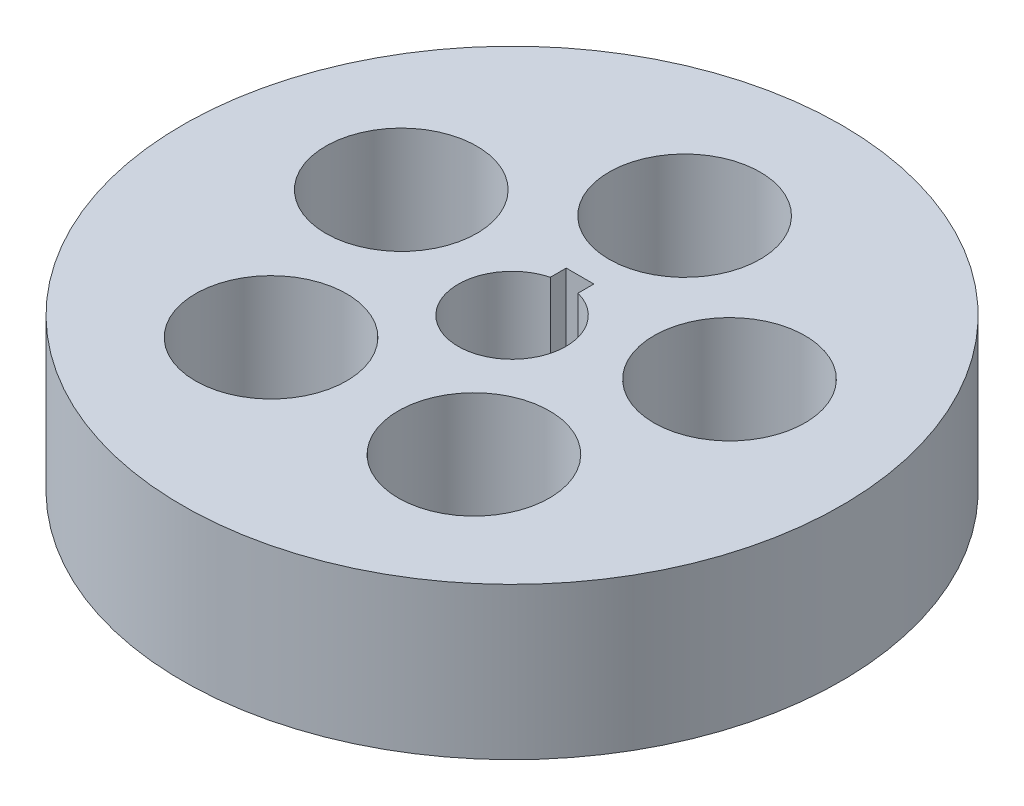
ISO-10303-21;
HEADER;
FILE_DESCRIPTION(('STEP AP214'),'2;1');
FILE_NAME('part.step','',(''),(''),'','','');
FILE_SCHEMA(('AUTOMOTIVE_DESIGN { 1 0 10303 214 1 1 1 1 }'));
ENDSEC;
DATA;
#1=APPLICATION_CONTEXT('core data for automotive mechanical design processes');
#2=APPLICATION_PROTOCOL_DEFINITION('international standard','automotive_design',2000,#1);
#3=PRODUCT_CONTEXT('',#1,'mechanical');
#4=PRODUCT('Part','Part','',(#3));
#5=PRODUCT_RELATED_PRODUCT_CATEGORY('part','',(#4));
#6=PRODUCT_DEFINITION_FORMATION('','',#4);
#7=PRODUCT_DEFINITION_CONTEXT('part definition',#1,'design');
#8=PRODUCT_DEFINITION('design','',#6,#7);
#9=PRODUCT_DEFINITION_SHAPE('','',#8);
#10=(LENGTH_UNIT() NAMED_UNIT(*) SI_UNIT(.MILLI.,.METRE.));
#11=(NAMED_UNIT(*) PLANE_ANGLE_UNIT() SI_UNIT($,.RADIAN.));
#12=(NAMED_UNIT(*) SI_UNIT($,.STERADIAN.) SOLID_ANGLE_UNIT());
#13=UNCERTAINTY_MEASURE_WITH_UNIT(LENGTH_MEASURE(1.E-05),#10,'distance_accuracy_value','');
#14=(GEOMETRIC_REPRESENTATION_CONTEXT(3) GLOBAL_UNCERTAINTY_ASSIGNED_CONTEXT((#13)) GLOBAL_UNIT_ASSIGNED_CONTEXT((#10,
#11,#12)) REPRESENTATION_CONTEXT('',''));
#15=CARTESIAN_POINT('',(0.,0.,0.));
#16=DIRECTION('',(0.,0.,1.));
#17=DIRECTION('',(1.,0.,0.));
#18=AXIS2_PLACEMENT_3D('',#15,#16,#17);
#19=CARTESIAN_POINT('',(-1.016,0.,-5.0038));
#20=DIRECTION('',(-1.,0.,0.));
#21=DIRECTION('',(0.,0.,1.));
#22=AXIS2_PLACEMENT_3D('',#19,#20,#21);
#23=PLANE('',#22);
#24=DIRECTION('',(0.,1.,0.));
#25=VECTOR('',#24,1.);
#26=CARTESIAN_POINT('',(-1.016,0.,-3.83649847680147));
#27=LINE('',#26,#25);
#28=CARTESIAN_POINT('',(-1.016,11.176,-3.83649847680147));
#29=VERTEX_POINT('',#28);
#30=CARTESIAN_POINT('',(-1.016,0.,-3.83649847680147));
#31=VERTEX_POINT('',#30);
#32=EDGE_CURVE('E63',#29,#31,#27,.F.);
#33=ORIENTED_EDGE('',*,*,#32,.T.);
#34=DIRECTION('',(0.,0.,1.));
#35=VECTOR('',#34,1.);
#36=CARTESIAN_POINT('',(-1.016,0.,-5.0038));
#37=LINE('',#36,#35);
#38=CARTESIAN_POINT('',(-1.016,0.,-5.0038));
#39=VERTEX_POINT('',#38);
#40=EDGE_CURVE('E34',#39,#31,#37,.T.);
#41=ORIENTED_EDGE('',*,*,#40,.F.);
#42=DIRECTION('',(0.,1.,0.));
#43=VECTOR('',#42,1.);
#44=CARTESIAN_POINT('',(-1.016,0.,-5.0038));
#45=LINE('',#44,#43);
#46=CARTESIAN_POINT('',(-1.016,11.176,-5.0038));
#47=VERTEX_POINT('',#46);
#48=EDGE_CURVE('E100',#47,#39,#45,.F.);
#49=ORIENTED_EDGE('',*,*,#48,.F.);
#50=DIRECTION('',(0.,0.,1.));
#51=VECTOR('',#50,1.);
#52=CARTESIAN_POINT('',(-1.016,11.176,0.));
#53=LINE('',#52,#51);
#54=EDGE_CURVE('E48',#29,#47,#53,.F.);
#55=ORIENTED_EDGE('',*,*,#54,.F.);
#56=EDGE_LOOP('',(#33,#41,#49,#55));
#57=FACE_BOUND('',#56,.T.);
#58=ADVANCED_FACE('F16',(#57),#23,.F.);
#59=CARTESIAN_POINT('',(1.016,0.,-5.0038));
#60=DIRECTION('',(-1.,0.,0.));
#61=DIRECTION('',(0.,0.,1.));
#62=AXIS2_PLACEMENT_3D('',#59,#60,#61);
#63=PLANE('',#62);
#64=DIRECTION('',(0.,0.,1.));
#65=VECTOR('',#64,1.);
#66=CARTESIAN_POINT('',(1.016,0.,-5.0038));
#67=LINE('',#66,#65);
#68=CARTESIAN_POINT('',(1.016,0.,-5.0038));
#69=VERTEX_POINT('',#68);
#70=CARTESIAN_POINT('',(1.016,0.,-3.83649847680147));
#71=VERTEX_POINT('',#70);
#72=EDGE_CURVE('E78',#69,#71,#67,.T.);
#73=ORIENTED_EDGE('',*,*,#72,.T.);
#74=DIRECTION('',(0.,1.,0.));
#75=VECTOR('',#74,1.);
#76=CARTESIAN_POINT('',(1.016,0.,-3.83649847680147));
#77=LINE('',#76,#75);
#78=CARTESIAN_POINT('',(1.016,11.176,-3.83649847680147));
#79=VERTEX_POINT('',#78);
#80=EDGE_CURVE('E61',#71,#79,#77,.T.);
#81=ORIENTED_EDGE('',*,*,#80,.T.);
#82=DIRECTION('',(0.,0.,1.));
#83=VECTOR('',#82,1.);
#84=CARTESIAN_POINT('',(1.016,11.176,0.));
#85=LINE('',#84,#83);
#86=CARTESIAN_POINT('',(1.016,11.176,-5.0038));
#87=VERTEX_POINT('',#86);
#88=EDGE_CURVE('E67',#87,#79,#85,.T.);
#89=ORIENTED_EDGE('',*,*,#88,.F.);
#90=DIRECTION('',(0.,1.,0.));
#91=VECTOR('',#90,1.);
#92=CARTESIAN_POINT('',(1.016,0.,-5.0038));
#93=LINE('',#92,#91);
#94=EDGE_CURVE('E97',#69,#87,#93,.T.);
#95=ORIENTED_EDGE('',*,*,#94,.F.);
#96=EDGE_LOOP('',(#73,#81,#89,#95));
#97=FACE_BOUND('',#96,.T.);
#98=ADVANCED_FACE('F76',(#97),#63,.T.);
#99=CARTESIAN_POINT('',(0.,11.176,0.));
#100=DIRECTION('',(0.,1.,0.));
#101=DIRECTION('',(0.,0.,1.));
#102=AXIS2_PLACEMENT_3D('',#99,#100,#101);
#103=PLANE('',#102);
#104=CARTESIAN_POINT('',(0.,11.176,0.));
#105=DIRECTION('',(0.,-1.,0.));
#106=DIRECTION('',(0.,0.,-1.));
#107=AXIS2_PLACEMENT_3D('',#104,#105,#106);
#108=CIRCLE('',#107,24.257);
#109=CARTESIAN_POINT('',(0.,11.176,-24.257));
#110=VERTEX_POINT('',#109);
#111=EDGE_CURVE('E99',#110,#110,#108,.T.);
#112=ORIENTED_EDGE('',*,*,#111,.F.);
#113=EDGE_LOOP('',(#112));
#114=FACE_BOUND('',#113,.T.);
#115=ORIENTED_EDGE('',*,*,#88,.T.);
#116=CARTESIAN_POINT('',(0.,11.176,0.));
#117=DIRECTION('',(0.,1.,0.));
#118=DIRECTION('',(0.,0.,1.));
#119=AXIS2_PLACEMENT_3D('',#116,#117,#118);
#120=CIRCLE('',#119,3.96875);
#121=EDGE_CURVE('E57',#79,#29,#120,.F.);
#122=ORIENTED_EDGE('',*,*,#121,.T.);
#123=ORIENTED_EDGE('',*,*,#54,.T.);
#124=DIRECTION('',(1.,0.,0.));
#125=VECTOR('',#124,1.);
#126=CARTESIAN_POINT('',(-1.016,11.176,-5.0038));
#127=LINE('',#126,#125);
#128=EDGE_CURVE('E71',#87,#47,#127,.F.);
#129=ORIENTED_EDGE('',*,*,#128,.F.);
#130=EDGE_LOOP('',(#115,#122,#123,#129));
#131=FACE_BOUND('',#130,.T.);
#132=CARTESIAN_POINT('',(0.,11.176,-12.7));
#133=DIRECTION('',(0.,1.,0.));
#134=DIRECTION('',(0.,0.,1.));
#135=AXIS2_PLACEMENT_3D('',#132,#133,#134);
#136=CIRCLE('',#135,5.5626);
#137=CARTESIAN_POINT('',(0.,11.176,-7.1374));
#138=VERTEX_POINT('',#137);
#139=EDGE_CURVE('E79',#138,#138,#136,.F.);
#140=ORIENTED_EDGE('',*,*,#139,.T.);
#141=EDGE_LOOP('',(#140));
#142=FACE_BOUND('',#141,.T.);
#143=CARTESIAN_POINT('',(12.0784177569485,11.176,-3.9245158285618));
#144=DIRECTION('',(0.,1.,0.));
#145=DIRECTION('',(0.,0.,1.));
#146=AXIS2_PLACEMENT_3D('',#143,#144,#145);
#147=CIRCLE('',#146,5.5626);
#148=CARTESIAN_POINT('',(12.0784177569485,11.176,1.6380841714382));
#149=VERTEX_POINT('',#148);
#150=EDGE_CURVE('E82',#149,#149,#147,.F.);
#151=ORIENTED_EDGE('',*,*,#150,.T.);
#152=EDGE_LOOP('',(#151));
#153=FACE_BOUND('',#152,.T.);
#154=CARTESIAN_POINT('',(7.46487270411435,11.176,10.2745158285619));
#155=DIRECTION('',(0.,1.,0.));
#156=DIRECTION('',(0.,0.,1.));
#157=AXIS2_PLACEMENT_3D('',#154,#155,#156);
#158=CIRCLE('',#157,5.5626);
#159=CARTESIAN_POINT('',(7.46487270411435,11.176,15.8371158285619));
#160=VERTEX_POINT('',#159);
#161=EDGE_CURVE('E134',#160,#160,#158,.F.);
#162=ORIENTED_EDGE('',*,*,#161,.T.);
#163=EDGE_LOOP('',(#162));
#164=FACE_BOUND('',#163,.T.);
#165=CARTESIAN_POINT('',(-7.4648727041145,11.176,10.2745158285618));
#166=DIRECTION('',(0.,1.,0.));
#167=DIRECTION('',(0.,0.,1.));
#168=AXIS2_PLACEMENT_3D('',#165,#166,#167);
#169=CIRCLE('',#168,5.5626);
#170=CARTESIAN_POINT('',(-7.4648727041145,11.176,15.8371158285618));
#171=VERTEX_POINT('',#170);
#172=EDGE_CURVE('E136',#171,#171,#169,.F.);
#173=ORIENTED_EDGE('',*,*,#172,.T.);
#174=EDGE_LOOP('',(#173));
#175=FACE_BOUND('',#174,.T.);
#176=CARTESIAN_POINT('',(-12.0784177569484,11.176,-3.92451582856197));
#177=DIRECTION('',(0.,1.,0.));
#178=DIRECTION('',(0.,0.,1.));
#179=AXIS2_PLACEMENT_3D('',#176,#177,#178);
#180=CIRCLE('',#179,5.5626);
#181=CARTESIAN_POINT('',(-12.0784177569484,11.176,1.63808417143803));
#182=VERTEX_POINT('',#181);
#183=EDGE_CURVE('E19',#182,#182,#180,.F.);
#184=ORIENTED_EDGE('',*,*,#183,.T.);
#185=EDGE_LOOP('',(#184));
#186=FACE_BOUND('',#185,.T.);
#187=ADVANCED_FACE('F68',(#114,#131,#142,#153,#164,#175,#186),#103,.T.);
#188=CARTESIAN_POINT('',(-12.0784177569484,0.,-3.92451582856197));
#189=DIRECTION('',(0.,1.,0.));
#190=DIRECTION('',(0.,0.,1.));
#191=AXIS2_PLACEMENT_3D('',#188,#189,#190);
#192=CYLINDRICAL_SURFACE('',#191,5.5626);
#193=CARTESIAN_POINT('',(-12.0784177569484,0.,-3.92451582856197));
#194=DIRECTION('',(0.,1.,0.));
#195=DIRECTION('',(0.,0.,1.));
#196=AXIS2_PLACEMENT_3D('',#193,#194,#195);
#197=CIRCLE('',#196,5.5626);
#198=CARTESIAN_POINT('',(-12.0784177569484,0.,1.63808417143803));
#199=VERTEX_POINT('',#198);
#200=EDGE_CURVE('E127',#199,#199,#197,.F.);
#201=ORIENTED_EDGE('',*,*,#200,.T.);
#202=EDGE_LOOP('',(#201));
#203=FACE_BOUND('',#202,.T.);
#204=ORIENTED_EDGE('',*,*,#183,.F.);
#205=EDGE_LOOP('',(#204));
#206=FACE_BOUND('',#205,.T.);
#207=ADVANCED_FACE('F144',(#203,#206),#192,.F.);
#208=CARTESIAN_POINT('',(-7.4648727041145,0.,10.2745158285618));
#209=DIRECTION('',(0.,1.,0.));
#210=DIRECTION('',(0.,0.,1.));
#211=AXIS2_PLACEMENT_3D('',#208,#209,#210);
#212=CYLINDRICAL_SURFACE('',#211,5.5626);
#213=CARTESIAN_POINT('',(-7.4648727041145,0.,10.2745158285618));
#214=DIRECTION('',(0.,1.,0.));
#215=DIRECTION('',(0.,0.,1.));
#216=AXIS2_PLACEMENT_3D('',#213,#214,#215);
#217=CIRCLE('',#216,5.5626);
#218=CARTESIAN_POINT('',(-7.4648727041145,0.,15.8371158285618));
#219=VERTEX_POINT('',#218);
#220=EDGE_CURVE('E124',#219,#219,#217,.F.);
#221=ORIENTED_EDGE('',*,*,#220,.T.);
#222=EDGE_LOOP('',(#221));
#223=FACE_BOUND('',#222,.T.);
#224=ORIENTED_EDGE('',*,*,#172,.F.);
#225=EDGE_LOOP('',(#224));
#226=FACE_BOUND('',#225,.T.);
#227=ADVANCED_FACE('F146',(#223,#226),#212,.F.);
#228=CARTESIAN_POINT('',(7.46487270411435,0.,10.2745158285619));
#229=DIRECTION('',(0.,1.,0.));
#230=DIRECTION('',(0.,0.,1.));
#231=AXIS2_PLACEMENT_3D('',#228,#229,#230);
#232=CYLINDRICAL_SURFACE('',#231,5.5626);
#233=CARTESIAN_POINT('',(7.46487270411435,0.,10.2745158285619));
#234=DIRECTION('',(0.,1.,0.));
#235=DIRECTION('',(0.,0.,1.));
#236=AXIS2_PLACEMENT_3D('',#233,#234,#235);
#237=CIRCLE('',#236,5.5626);
#238=CARTESIAN_POINT('',(7.46487270411435,0.,15.8371158285619));
#239=VERTEX_POINT('',#238);
#240=EDGE_CURVE('E121',#239,#239,#237,.F.);
#241=ORIENTED_EDGE('',*,*,#240,.T.);
#242=EDGE_LOOP('',(#241));
#243=FACE_BOUND('',#242,.T.);
#244=ORIENTED_EDGE('',*,*,#161,.F.);
#245=EDGE_LOOP('',(#244));
#246=FACE_BOUND('',#245,.T.);
#247=ADVANCED_FACE('F154',(#243,#246),#232,.F.);
#248=CARTESIAN_POINT('',(12.0784177569485,0.,-3.9245158285618));
#249=DIRECTION('',(0.,1.,0.));
#250=DIRECTION('',(0.,0.,1.));
#251=AXIS2_PLACEMENT_3D('',#248,#249,#250);
#252=CYLINDRICAL_SURFACE('',#251,5.5626);
#253=CARTESIAN_POINT('',(12.0784177569485,0.,-3.9245158285618));
#254=DIRECTION('',(0.,1.,0.));
#255=DIRECTION('',(0.,0.,1.));
#256=AXIS2_PLACEMENT_3D('',#253,#254,#255);
#257=CIRCLE('',#256,5.5626);
#258=CARTESIAN_POINT('',(12.0784177569485,0.,1.6380841714382));
#259=VERTEX_POINT('',#258);
#260=EDGE_CURVE('E118',#259,#259,#257,.F.);
#261=ORIENTED_EDGE('',*,*,#260,.T.);
#262=EDGE_LOOP('',(#261));
#263=FACE_BOUND('',#262,.T.);
#264=ORIENTED_EDGE('',*,*,#150,.F.);
#265=EDGE_LOOP('',(#264));
#266=FACE_BOUND('',#265,.T.);
#267=ADVANCED_FACE('F181',(#263,#266),#252,.F.);
#268=CARTESIAN_POINT('',(0.,0.,-12.7));
#269=DIRECTION('',(0.,1.,0.));
#270=DIRECTION('',(0.,0.,1.));
#271=AXIS2_PLACEMENT_3D('',#268,#269,#270);
#272=CYLINDRICAL_SURFACE('',#271,5.5626);
#273=CARTESIAN_POINT('',(0.,0.,-12.7));
#274=DIRECTION('',(0.,1.,0.));
#275=DIRECTION('',(0.,0.,1.));
#276=AXIS2_PLACEMENT_3D('',#273,#274,#275);
#277=CIRCLE('',#276,5.5626);
#278=CARTESIAN_POINT('',(0.,0.,-7.1374));
#279=VERTEX_POINT('',#278);
#280=EDGE_CURVE('E115',#279,#279,#277,.F.);
#281=ORIENTED_EDGE('',*,*,#280,.T.);
#282=EDGE_LOOP('',(#281));
#283=FACE_BOUND('',#282,.T.);
#284=ORIENTED_EDGE('',*,*,#139,.F.);
#285=EDGE_LOOP('',(#284));
#286=FACE_BOUND('',#285,.T.);
#287=ADVANCED_FACE('F178',(#283,#286),#272,.F.);
#288=CARTESIAN_POINT('',(0.,0.,0.));
#289=DIRECTION('',(0.,1.,0.));
#290=DIRECTION('',(0.,0.,1.));
#291=AXIS2_PLACEMENT_3D('',#288,#289,#290);
#292=CYLINDRICAL_SURFACE('',#291,3.96875);
#293=CARTESIAN_POINT('',(0.,0.,0.));
#294=DIRECTION('',(0.,1.,0.));
#295=DIRECTION('',(0.,0.,1.));
#296=AXIS2_PLACEMENT_3D('',#293,#294,#295);
#297=CIRCLE('',#296,3.96875);
#298=EDGE_CURVE('E111',#71,#31,#297,.F.);
#299=ORIENTED_EDGE('',*,*,#298,.T.);
#300=ORIENTED_EDGE('',*,*,#32,.F.);
#301=ORIENTED_EDGE('',*,*,#121,.F.);
#302=ORIENTED_EDGE('',*,*,#80,.F.);
#303=EDGE_LOOP('',(#299,#300,#301,#302));
#304=FACE_BOUND('',#303,.T.);
#305=ADVANCED_FACE('F59',(#304),#292,.F.);
#306=CARTESIAN_POINT('',(-1.016,0.,-5.0038));
#307=DIRECTION('',(0.,0.,1.));
#308=DIRECTION('',(1.,0.,0.));
#309=AXIS2_PLACEMENT_3D('',#306,#307,#308);
#310=PLANE('',#309);
#311=DIRECTION('',(1.,0.,0.));
#312=VECTOR('',#311,1.);
#313=CARTESIAN_POINT('',(0.,0.,-5.0038));
#314=LINE('',#313,#312);
#315=EDGE_CURVE('E25',#39,#69,#314,.T.);
#316=ORIENTED_EDGE('',*,*,#315,.T.);
#317=ORIENTED_EDGE('',*,*,#94,.T.);
#318=ORIENTED_EDGE('',*,*,#128,.T.);
#319=ORIENTED_EDGE('',*,*,#48,.T.);
#320=EDGE_LOOP('',(#316,#317,#318,#319));
#321=FACE_BOUND('',#320,.T.);
#322=ADVANCED_FACE('F167',(#321),#310,.T.);
#323=CARTESIAN_POINT('',(0.,11.176,0.));
#324=DIRECTION('',(0.,-1.,0.));
#325=DIRECTION('',(0.,0.,-1.));
#326=AXIS2_PLACEMENT_3D('',#323,#324,#325);
#327=CYLINDRICAL_SURFACE('',#326,24.257);
#328=ORIENTED_EDGE('',*,*,#111,.T.);
#329=EDGE_LOOP('',(#328));
#330=FACE_BOUND('',#329,.T.);
#331=CARTESIAN_POINT('',(0.,0.,0.));
#332=DIRECTION('',(0.,-1.,0.));
#333=DIRECTION('',(0.,0.,-1.));
#334=AXIS2_PLACEMENT_3D('',#331,#332,#333);
#335=CIRCLE('',#334,24.257);
#336=CARTESIAN_POINT('',(0.,0.,-24.257));
#337=VERTEX_POINT('',#336);
#338=EDGE_CURVE('E11',#337,#337,#335,.F.);
#339=ORIENTED_EDGE('',*,*,#338,.T.);
#340=EDGE_LOOP('',(#339));
#341=FACE_BOUND('',#340,.T.);
#342=ADVANCED_FACE('F161',(#330,#341),#327,.T.);
#343=CARTESIAN_POINT('',(0.,0.,0.));
#344=DIRECTION('',(0.,1.,0.));
#345=DIRECTION('',(0.,0.,1.));
#346=AXIS2_PLACEMENT_3D('',#343,#344,#345);
#347=PLANE('',#346);
#348=ORIENTED_EDGE('',*,*,#338,.F.);
#349=EDGE_LOOP('',(#348));
#350=FACE_BOUND('',#349,.T.);
#351=ORIENTED_EDGE('',*,*,#40,.T.);
#352=ORIENTED_EDGE('',*,*,#298,.F.);
#353=ORIENTED_EDGE('',*,*,#72,.F.);
#354=ORIENTED_EDGE('',*,*,#315,.F.);
#355=EDGE_LOOP('',(#351,#352,#353,#354));
#356=FACE_BOUND('',#355,.T.);
#357=ORIENTED_EDGE('',*,*,#280,.F.);
#358=EDGE_LOOP('',(#357));
#359=FACE_BOUND('',#358,.T.);
#360=ORIENTED_EDGE('',*,*,#260,.F.);
#361=EDGE_LOOP('',(#360));
#362=FACE_BOUND('',#361,.T.);
#363=ORIENTED_EDGE('',*,*,#240,.F.);
#364=EDGE_LOOP('',(#363));
#365=FACE_BOUND('',#364,.T.);
#366=ORIENTED_EDGE('',*,*,#220,.F.);
#367=EDGE_LOOP('',(#366));
#368=FACE_BOUND('',#367,.T.);
#369=ORIENTED_EDGE('',*,*,#200,.F.);
#370=EDGE_LOOP('',(#369));
#371=FACE_BOUND('',#370,.T.);
#372=ADVANCED_FACE('F159',(#350,#356,#359,#362,#365,#368,#371),#347,.F.);
#373=CLOSED_SHELL('',(#58,#98,#187,#207,#227,#247,#267,#287,#305,#322,#342,#372));
#374=MANIFOLD_SOLID_BREP('B1',#373);
#375=ADVANCED_BREP_SHAPE_REPRESENTATION('',(#18,#374),#14);
#376=SHAPE_DEFINITION_REPRESENTATION(#9,#375);
ENDSEC;
END-ISO-10303-21;
